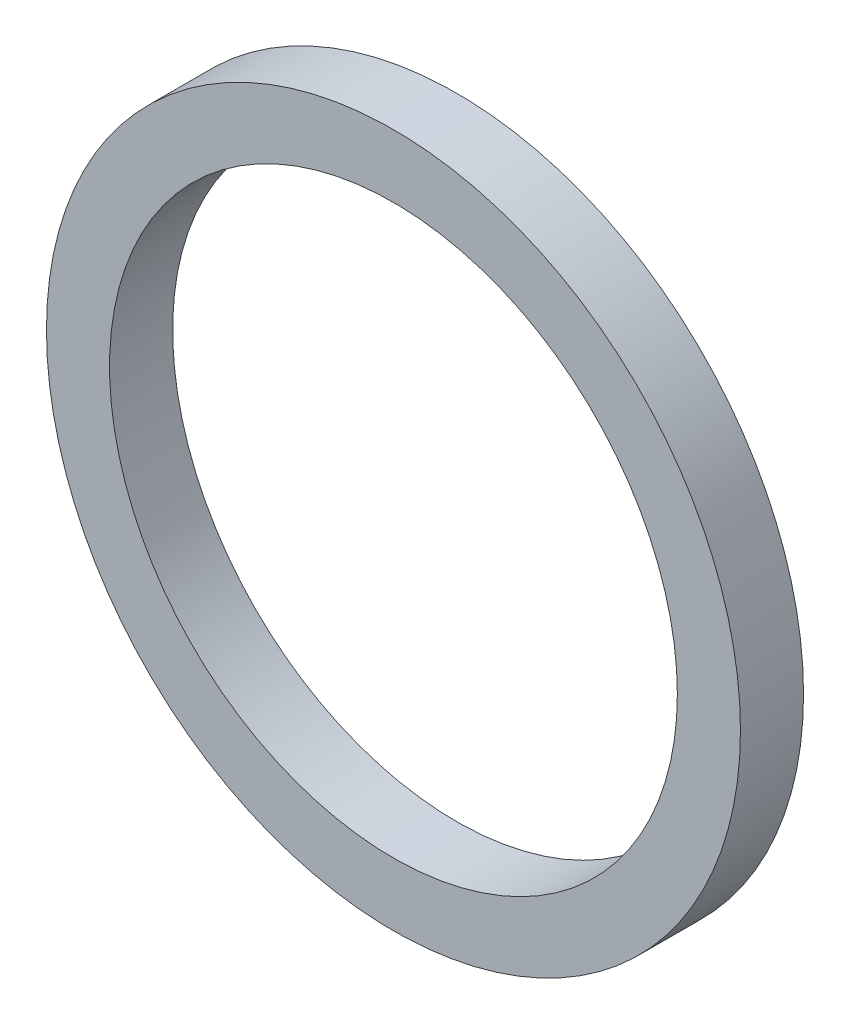
ISO-10303-21;
HEADER;
FILE_DESCRIPTION(('STEP AP214'),'2;1');
FILE_NAME('part.step','',(''),(''),'','','');
FILE_SCHEMA(('AUTOMOTIVE_DESIGN { 1 0 10303 214 1 1 1 1 }'));
ENDSEC;
DATA;
#1=APPLICATION_CONTEXT('core data for automotive mechanical design processes');
#2=APPLICATION_PROTOCOL_DEFINITION('international standard','automotive_design',2000,#1);
#3=PRODUCT_CONTEXT('',#1,'mechanical');
#4=PRODUCT('Part','Part','',(#3));
#5=PRODUCT_RELATED_PRODUCT_CATEGORY('part','',(#4));
#6=PRODUCT_DEFINITION_FORMATION('','',#4);
#7=PRODUCT_DEFINITION_CONTEXT('part definition',#1,'design');
#8=PRODUCT_DEFINITION('design','',#6,#7);
#9=PRODUCT_DEFINITION_SHAPE('','',#8);
#10=(LENGTH_UNIT() NAMED_UNIT(*) SI_UNIT(.MILLI.,.METRE.));
#11=(NAMED_UNIT(*) PLANE_ANGLE_UNIT() SI_UNIT($,.RADIAN.));
#12=(NAMED_UNIT(*) SI_UNIT($,.STERADIAN.) SOLID_ANGLE_UNIT());
#13=UNCERTAINTY_MEASURE_WITH_UNIT(LENGTH_MEASURE(1.E-05),#10,'distance_accuracy_value','');
#14=(GEOMETRIC_REPRESENTATION_CONTEXT(3) GLOBAL_UNCERTAINTY_ASSIGNED_CONTEXT((#13)) GLOBAL_UNIT_ASSIGNED_CONTEXT((#10,
#11,#12)) REPRESENTATION_CONTEXT('',''));
#15=CARTESIAN_POINT('',(0.,0.,0.));
#16=DIRECTION('',(0.,0.,1.));
#17=DIRECTION('',(1.,0.,0.));
#18=AXIS2_PLACEMENT_3D('',#15,#16,#17);
#19=CARTESIAN_POINT('',(0.,0.,1.));
#20=DIRECTION('',(0.,0.,1.));
#21=DIRECTION('',(1.,0.,0.));
#22=AXIS2_PLACEMENT_3D('',#19,#20,#21);
#23=PLANE('',#22);
#24=CARTESIAN_POINT('',(0.,0.,1.));
#25=DIRECTION('',(0.,0.,1.));
#26=DIRECTION('',(1.,0.,0.));
#27=AXIS2_PLACEMENT_3D('',#24,#25,#26);
#28=CIRCLE('',#27,5.5);
#29=CARTESIAN_POINT('',(5.5,0.,1.));
#30=VERTEX_POINT('',#29);
#31=EDGE_CURVE('E10',#30,#30,#28,.T.);
#32=ORIENTED_EDGE('',*,*,#31,.T.);
#33=EDGE_LOOP('',(#32));
#34=FACE_BOUND('',#33,.T.);
#35=CARTESIAN_POINT('',(0.,0.,1.));
#36=DIRECTION('',(0.,0.,1.));
#37=DIRECTION('',(1.,0.,0.));
#38=AXIS2_PLACEMENT_3D('',#35,#36,#37);
#39=CIRCLE('',#38,4.5);
#40=CARTESIAN_POINT('',(4.5,0.,1.));
#41=VERTEX_POINT('',#40);
#42=EDGE_CURVE('E56',#41,#41,#39,.T.);
#43=ORIENTED_EDGE('',*,*,#42,.F.);
#44=EDGE_LOOP('',(#43));
#45=FACE_BOUND('',#44,.T.);
#46=ADVANCED_FACE('F43',(#34,#45),#23,.T.);
#47=CARTESIAN_POINT('',(0.,0.,0.));
#48=DIRECTION('',(0.,0.,1.));
#49=DIRECTION('',(1.,0.,0.));
#50=AXIS2_PLACEMENT_3D('',#47,#48,#49);
#51=PLANE('',#50);
#52=CARTESIAN_POINT('',(0.,0.,0.));
#53=DIRECTION('',(0.,0.,1.));
#54=DIRECTION('',(1.,0.,0.));
#55=AXIS2_PLACEMENT_3D('',#52,#53,#54);
#56=CIRCLE('',#55,5.5);
#57=CARTESIAN_POINT('',(5.5,0.,0.));
#58=VERTEX_POINT('',#57);
#59=EDGE_CURVE('E47',#58,#58,#56,.T.);
#60=ORIENTED_EDGE('',*,*,#59,.F.);
#61=EDGE_LOOP('',(#60));
#62=FACE_BOUND('',#61,.T.);
#63=CARTESIAN_POINT('',(0.,0.,0.));
#64=DIRECTION('',(0.,0.,1.));
#65=DIRECTION('',(1.,0.,0.));
#66=AXIS2_PLACEMENT_3D('',#63,#64,#65);
#67=CIRCLE('',#66,4.5);
#68=CARTESIAN_POINT('',(4.5,0.,0.));
#69=VERTEX_POINT('',#68);
#70=EDGE_CURVE('E58',#69,#69,#67,.T.);
#71=ORIENTED_EDGE('',*,*,#70,.T.);
#72=EDGE_LOOP('',(#71));
#73=FACE_BOUND('',#72,.T.);
#74=ADVANCED_FACE('F70',(#62,#73),#51,.F.);
#75=CARTESIAN_POINT('',(0.,0.,1.));
#76=DIRECTION('',(0.,0.,-1.));
#77=DIRECTION('',(-1.,0.,0.));
#78=AXIS2_PLACEMENT_3D('',#75,#76,#77);
#79=CYLINDRICAL_SURFACE('',#78,5.5);
#80=ORIENTED_EDGE('',*,*,#31,.F.);
#81=EDGE_LOOP('',(#80));
#82=FACE_BOUND('',#81,.T.);
#83=ORIENTED_EDGE('',*,*,#59,.T.);
#84=EDGE_LOOP('',(#83));
#85=FACE_BOUND('',#84,.T.);
#86=ADVANCED_FACE('F45',(#82,#85),#79,.T.);
#87=CARTESIAN_POINT('',(0.,0.,1.));
#88=DIRECTION('',(0.,0.,-1.));
#89=DIRECTION('',(-1.,0.,0.));
#90=AXIS2_PLACEMENT_3D('',#87,#88,#89);
#91=CYLINDRICAL_SURFACE('',#90,4.5);
#92=ORIENTED_EDGE('',*,*,#42,.T.);
#93=EDGE_LOOP('',(#92));
#94=FACE_BOUND('',#93,.T.);
#95=ORIENTED_EDGE('',*,*,#70,.F.);
#96=EDGE_LOOP('',(#95));
#97=FACE_BOUND('',#96,.T.);
#98=ADVANCED_FACE('F66',(#94,#97),#91,.F.);
#99=CLOSED_SHELL('',(#46,#74,#86,#98));
#100=MANIFOLD_SOLID_BREP('B2',#99);
#101=ADVANCED_BREP_SHAPE_REPRESENTATION('',(#18,#100),#14);
#102=SHAPE_DEFINITION_REPRESENTATION(#9,#101);
ENDSEC;
END-ISO-10303-21;
